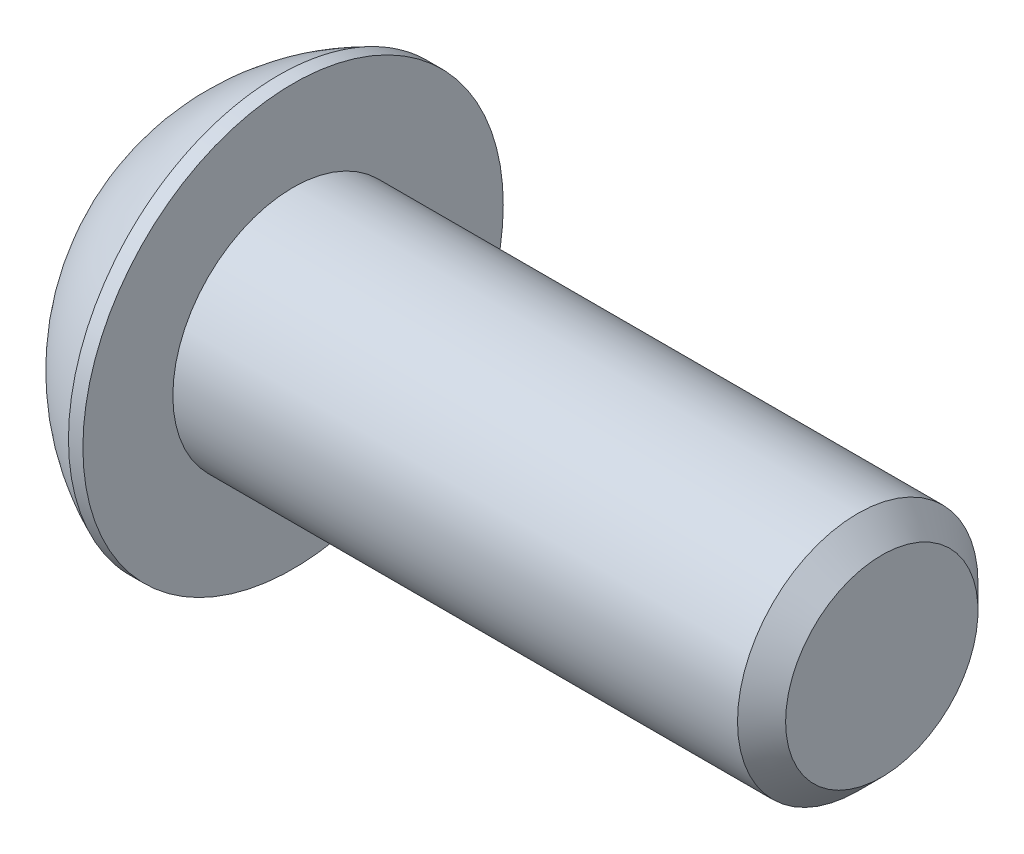
ISO-10303-21;
HEADER;
FILE_DESCRIPTION(('STEP AP214'),'2;1');
FILE_NAME('part.step','',(''),(''),'','','');
FILE_SCHEMA(('AUTOMOTIVE_DESIGN { 1 0 10303 214 1 1 1 1 }'));
ENDSEC;
DATA;
#1=APPLICATION_CONTEXT('core data for automotive mechanical design processes');
#2=APPLICATION_PROTOCOL_DEFINITION('international standard','automotive_design',2000,#1);
#3=PRODUCT_CONTEXT('',#1,'mechanical');
#4=PRODUCT('Part','Part','',(#3));
#5=PRODUCT_RELATED_PRODUCT_CATEGORY('part','',(#4));
#6=PRODUCT_DEFINITION_FORMATION('','',#4);
#7=PRODUCT_DEFINITION_CONTEXT('part definition',#1,'design');
#8=PRODUCT_DEFINITION('design','',#6,#7);
#9=PRODUCT_DEFINITION_SHAPE('','',#8);
#10=(LENGTH_UNIT() NAMED_UNIT(*) SI_UNIT(.MILLI.,.METRE.));
#11=(NAMED_UNIT(*) PLANE_ANGLE_UNIT() SI_UNIT($,.RADIAN.));
#12=(NAMED_UNIT(*) SI_UNIT($,.STERADIAN.) SOLID_ANGLE_UNIT());
#13=UNCERTAINTY_MEASURE_WITH_UNIT(LENGTH_MEASURE(1.E-05),#10,'distance_accuracy_value','');
#14=(GEOMETRIC_REPRESENTATION_CONTEXT(3) GLOBAL_UNCERTAINTY_ASSIGNED_CONTEXT((#13)) GLOBAL_UNIT_ASSIGNED_CONTEXT((#10,
#11,#12)) REPRESENTATION_CONTEXT('',''));
#15=CARTESIAN_POINT('',(0.,0.,0.));
#16=DIRECTION('',(0.,0.,1.));
#17=DIRECTION('',(1.,0.,0.));
#18=AXIS2_PLACEMENT_3D('',#15,#16,#17);
#19=CARTESIAN_POINT('',(1.32080000000034,0.,0.));
#20=DIRECTION('',(-1.,0.,0.));
#21=DIRECTION('',(0.,0.,1.));
#22=AXIS2_PLACEMENT_3D('',#19,#20,#21);
#23=CONICAL_SURFACE('',#22,1.1937999999998,1.04719755119608);
#24=CARTESIAN_POINT('',(2.01004075135902,0.,-4.44089209850063E-13));
#25=VERTEX_POINT('',#24);
#26=VERTEX_LOOP('',#25);
#27=FACE_BOUND('',#26,.T.);
#28=CARTESIAN_POINT('',(1.32080000000009,0.,0.));
#29=DIRECTION('',(-1.,0.,0.));
#30=DIRECTION('',(0.,0.,1.));
#31=AXIS2_PLACEMENT_3D('',#28,#29,#30);
#32=CIRCLE('',#31,1.19380000000024);
#33=CARTESIAN_POINT('',(1.32080000000009,0.,1.19380000000024));
#34=VERTEX_POINT('',#33);
#35=EDGE_CURVE('E20',#34,#34,#32,.T.);
#36=ORIENTED_EDGE('',*,*,#35,.T.);
#37=EDGE_LOOP('',(#36));
#38=FACE_BOUND('',#37,.T.);
#39=ADVANCED_FACE('F17',(#27,#38),#23,.F.);
#40=CARTESIAN_POINT('',(1.3208,-2.29135888084633,0.));
#41=DIRECTION('',(1.,0.,0.));
#42=DIRECTION('',(0.,0.,-1.));
#43=AXIS2_PLACEMENT_3D('',#40,#41,#42);
#44=PLANE('',#43);
#45=DIRECTION('',(0.,1.,0.));
#46=VECTOR('',#45,1.);
#47=CARTESIAN_POINT('',(1.3208,-1.14567944042316,1.984375));
#48=LINE('',#47,#46);
#49=CARTESIAN_POINT('',(1.3208,1.14567944042316,1.984375));
#50=VERTEX_POINT('',#49);
#51=CARTESIAN_POINT('',(1.3208,-1.14567944042316,1.984375));
#52=VERTEX_POINT('',#51);
#53=EDGE_CURVE('E69',#50,#52,#48,.F.);
#54=ORIENTED_EDGE('',*,*,#53,.F.);
#55=DIRECTION('',(0.,0.5,-0.866025403784439));
#56=VECTOR('',#55,1.);
#57=CARTESIAN_POINT('',(1.3208,1.14567944042316,1.984375));
#58=LINE('',#57,#56);
#59=CARTESIAN_POINT('',(1.3208,2.29135888084633,0.));
#60=VERTEX_POINT('',#59);
#61=EDGE_CURVE('E292',#60,#50,#58,.F.);
#62=ORIENTED_EDGE('',*,*,#61,.F.);
#63=DIRECTION('',(0.,-0.5,-0.866025403784439));
#64=VECTOR('',#63,1.);
#65=CARTESIAN_POINT('',(1.3208,2.29135888084633,0.));
#66=LINE('',#65,#64);
#67=CARTESIAN_POINT('',(1.3208,1.14567944042316,-1.984375));
#68=VERTEX_POINT('',#67);
#69=EDGE_CURVE('E296',#68,#60,#66,.F.);
#70=ORIENTED_EDGE('',*,*,#69,.F.);
#71=DIRECTION('',(0.,1.,0.));
#72=VECTOR('',#71,1.);
#73=CARTESIAN_POINT('',(1.3208,1.14567944042316,-1.984375));
#74=LINE('',#73,#72);
#75=CARTESIAN_POINT('',(1.3208,-1.14567944042316,-1.984375));
#76=VERTEX_POINT('',#75);
#77=EDGE_CURVE('E301',#76,#68,#74,.T.);
#78=ORIENTED_EDGE('',*,*,#77,.F.);
#79=DIRECTION('',(0.,-0.500000000000001,0.866025403784438));
#80=VECTOR('',#79,1.);
#81=CARTESIAN_POINT('',(1.3208,-1.14567944042316,-1.984375));
#82=LINE('',#81,#80);
#83=CARTESIAN_POINT('',(1.3208,-2.29135888084633,0.));
#84=VERTEX_POINT('',#83);
#85=EDGE_CURVE('E306',#84,#76,#82,.F.);
#86=ORIENTED_EDGE('',*,*,#85,.F.);
#87=DIRECTION('',(0.,0.500000000000001,0.866025403784438));
#88=VECTOR('',#87,1.);
#89=CARTESIAN_POINT('',(1.3208,-2.29135888084633,0.));
#90=LINE('',#89,#88);
#91=EDGE_CURVE('E82',#52,#84,#90,.F.);
#92=ORIENTED_EDGE('',*,*,#91,.F.);
#93=EDGE_LOOP('',(#54,#62,#70,#78,#86,#92));
#94=FACE_BOUND('',#93,.T.);
#95=ORIENTED_EDGE('',*,*,#35,.F.);
#96=EDGE_LOOP('',(#95));
#97=FACE_BOUND('',#96,.T.);
#98=ADVANCED_FACE('F75',(#94,#97),#44,.F.);
#99=CARTESIAN_POINT('',(1.3208,-1.14567944042316,1.984375));
#100=DIRECTION('',(0.,0.,-1.));
#101=DIRECTION('',(0.,1.,0.));
#102=AXIS2_PLACEMENT_3D('',#99,#100,#101);
#103=PLANE('',#102);
#104=ORIENTED_EDGE('',*,*,#53,.T.);
#105=DIRECTION('',(1.,0.,0.));
#106=VECTOR('',#105,1.);
#107=CARTESIAN_POINT('',(1.3208,-1.14567944042316,1.984375));
#108=LINE('',#107,#106);
#109=CARTESIAN_POINT('',(0.,-1.14567944042316,1.984375));
#110=VERTEX_POINT('',#109);
#111=EDGE_CURVE('E79',#110,#52,#108,.T.);
#112=ORIENTED_EDGE('',*,*,#111,.F.);
#113=DIRECTION('',(0.,1.,0.));
#114=VECTOR('',#113,1.);
#115=CARTESIAN_POINT('',(0.,0.,1.984375));
#116=LINE('',#115,#114);
#117=CARTESIAN_POINT('',(0.,1.14567944042316,1.984375));
#118=VERTEX_POINT('',#117);
#119=EDGE_CURVE('E286',#118,#110,#116,.F.);
#120=ORIENTED_EDGE('',*,*,#119,.F.);
#121=DIRECTION('',(1.,0.,0.));
#122=VECTOR('',#121,1.);
#123=CARTESIAN_POINT('',(1.3208,1.14567944042316,1.984375));
#124=LINE('',#123,#122);
#125=EDGE_CURVE('E289',#50,#118,#124,.F.);
#126=ORIENTED_EDGE('',*,*,#125,.F.);
#127=EDGE_LOOP('',(#104,#112,#120,#126));
#128=FACE_BOUND('',#127,.T.);
#129=ADVANCED_FACE('F128',(#128),#103,.T.);
#130=CARTESIAN_POINT('',(1.3208,-2.29135888084633,0.));
#131=DIRECTION('',(0.,0.866025403784438,-0.500000000000001));
#132=DIRECTION('',(0.,0.500000000000001,0.866025403784438));
#133=AXIS2_PLACEMENT_3D('',#130,#131,#132);
#134=PLANE('',#133);
#135=ORIENTED_EDGE('',*,*,#91,.T.);
#136=DIRECTION('',(1.,0.,0.));
#137=VECTOR('',#136,1.);
#138=CARTESIAN_POINT('',(1.3208,-2.29135888084633,0.));
#139=LINE('',#138,#137);
#140=CARTESIAN_POINT('',(0.,-2.29135888084633,0.));
#141=VERTEX_POINT('',#140);
#142=EDGE_CURVE('E308',#141,#84,#139,.T.);
#143=ORIENTED_EDGE('',*,*,#142,.F.);
#144=DIRECTION('',(0.,-0.500000000000001,-0.866025403784438));
#145=VECTOR('',#144,1.);
#146=CARTESIAN_POINT('',(0.,-1.14567944042316,1.984375));
#147=LINE('',#146,#145);
#148=EDGE_CURVE('E283',#110,#141,#147,.T.);
#149=ORIENTED_EDGE('',*,*,#148,.F.);
#150=ORIENTED_EDGE('',*,*,#111,.T.);
#151=EDGE_LOOP('',(#135,#143,#149,#150));
#152=FACE_BOUND('',#151,.T.);
#153=ADVANCED_FACE('F124',(#152),#134,.T.);
#154=CARTESIAN_POINT('',(1.3208,-1.14567944042316,-1.984375));
#155=DIRECTION('',(0.,0.866025403784438,0.500000000000001));
#156=DIRECTION('',(0.,-0.500000000000001,0.866025403784438));
#157=AXIS2_PLACEMENT_3D('',#154,#155,#156);
#158=PLANE('',#157);
#159=ORIENTED_EDGE('',*,*,#85,.T.);
#160=DIRECTION('',(1.,0.,0.));
#161=VECTOR('',#160,1.);
#162=CARTESIAN_POINT('',(1.3208,-1.14567944042316,-1.984375));
#163=LINE('',#162,#161);
#164=CARTESIAN_POINT('',(0.,-1.14567944042316,-1.984375));
#165=VERTEX_POINT('',#164);
#166=EDGE_CURVE('E303',#165,#76,#163,.T.);
#167=ORIENTED_EDGE('',*,*,#166,.F.);
#168=DIRECTION('',(0.,0.500000000000001,-0.866025403784438));
#169=VECTOR('',#168,1.);
#170=CARTESIAN_POINT('',(0.,-2.29135888084633,0.));
#171=LINE('',#170,#169);
#172=EDGE_CURVE('E280',#141,#165,#171,.T.);
#173=ORIENTED_EDGE('',*,*,#172,.F.);
#174=ORIENTED_EDGE('',*,*,#142,.T.);
#175=EDGE_LOOP('',(#159,#167,#173,#174));
#176=FACE_BOUND('',#175,.T.);
#177=ADVANCED_FACE('F120',(#176),#158,.T.);
#178=CARTESIAN_POINT('',(1.3208,1.14567944042316,-1.984375));
#179=DIRECTION('',(0.,0.,1.));
#180=DIRECTION('',(1.,0.,0.));
#181=AXIS2_PLACEMENT_3D('',#178,#179,#180);
#182=PLANE('',#181);
#183=ORIENTED_EDGE('',*,*,#77,.T.);
#184=DIRECTION('',(1.,0.,0.));
#185=VECTOR('',#184,1.);
#186=CARTESIAN_POINT('',(1.3208,1.14567944042316,-1.984375));
#187=LINE('',#186,#185);
#188=CARTESIAN_POINT('',(0.,1.14567944042316,-1.984375));
#189=VERTEX_POINT('',#188);
#190=EDGE_CURVE('E298',#189,#68,#187,.T.);
#191=ORIENTED_EDGE('',*,*,#190,.F.);
#192=DIRECTION('',(0.,1.,0.));
#193=VECTOR('',#192,1.);
#194=CARTESIAN_POINT('',(0.,0.,-1.984375));
#195=LINE('',#194,#193);
#196=EDGE_CURVE('E277',#165,#189,#195,.T.);
#197=ORIENTED_EDGE('',*,*,#196,.F.);
#198=ORIENTED_EDGE('',*,*,#166,.T.);
#199=EDGE_LOOP('',(#183,#191,#197,#198));
#200=FACE_BOUND('',#199,.T.);
#201=ADVANCED_FACE('F117',(#200),#182,.T.);
#202=CARTESIAN_POINT('',(1.3208,2.29135888084633,0.));
#203=DIRECTION('',(0.,-0.866025403784439,0.5));
#204=DIRECTION('',(0.,-0.5,-0.866025403784439));
#205=AXIS2_PLACEMENT_3D('',#202,#203,#204);
#206=PLANE('',#205);
#207=ORIENTED_EDGE('',*,*,#69,.T.);
#208=DIRECTION('',(1.,0.,0.));
#209=VECTOR('',#208,1.);
#210=CARTESIAN_POINT('',(1.3208,2.29135888084633,0.));
#211=LINE('',#210,#209);
#212=CARTESIAN_POINT('',(0.,2.29135888084633,0.));
#213=VERTEX_POINT('',#212);
#214=EDGE_CURVE('E35',#213,#60,#211,.T.);
#215=ORIENTED_EDGE('',*,*,#214,.F.);
#216=DIRECTION('',(0.,0.5,0.866025403784439));
#217=VECTOR('',#216,1.);
#218=CARTESIAN_POINT('',(0.,1.14567944042316,-1.984375));
#219=LINE('',#218,#217);
#220=EDGE_CURVE('E274',#189,#213,#219,.T.);
#221=ORIENTED_EDGE('',*,*,#220,.F.);
#222=ORIENTED_EDGE('',*,*,#190,.T.);
#223=EDGE_LOOP('',(#207,#215,#221,#222));
#224=FACE_BOUND('',#223,.T.);
#225=ADVANCED_FACE('F113',(#224),#206,.T.);
#226=CARTESIAN_POINT('',(1.3208,1.14567944042316,1.984375));
#227=DIRECTION('',(0.,-0.866025403784439,-0.5));
#228=DIRECTION('',(0.,0.5,-0.866025403784439));
#229=AXIS2_PLACEMENT_3D('',#226,#227,#228);
#230=PLANE('',#229);
#231=ORIENTED_EDGE('',*,*,#61,.T.);
#232=ORIENTED_EDGE('',*,*,#125,.T.);
#233=DIRECTION('',(0.,-0.5,0.866025403784438));
#234=VECTOR('',#233,1.);
#235=CARTESIAN_POINT('',(0.,2.29135888084633,0.));
#236=LINE('',#235,#234);
#237=EDGE_CURVE('E100',#213,#118,#236,.T.);
#238=ORIENTED_EDGE('',*,*,#237,.F.);
#239=ORIENTED_EDGE('',*,*,#214,.T.);
#240=EDGE_LOOP('',(#231,#232,#238,#239));
#241=FACE_BOUND('',#240,.T.);
#242=ADVANCED_FACE('F109',(#241),#230,.T.);
#243=CARTESIAN_POINT('',(0.,0.,0.));
#244=DIRECTION('',(-1.,0.,0.));
#245=DIRECTION('',(0.,0.,1.));
#246=AXIS2_PLACEMENT_3D('',#243,#244,#245);
#247=PLANE('',#246);
#248=ORIENTED_EDGE('',*,*,#220,.T.);
#249=ORIENTED_EDGE('',*,*,#237,.T.);
#250=ORIENTED_EDGE('',*,*,#119,.T.);
#251=ORIENTED_EDGE('',*,*,#148,.T.);
#252=ORIENTED_EDGE('',*,*,#172,.T.);
#253=ORIENTED_EDGE('',*,*,#196,.T.);
#254=EDGE_LOOP('',(#248,#249,#250,#251,#252,#253));
#255=FACE_BOUND('',#254,.T.);
#256=CARTESIAN_POINT('',(0.,2.77495,0.));
#257=CARTESIAN_POINT('',(0.,2.77494953309947,0.0779118937523459));
#258=CARTESIAN_POINT('',(0.,2.77166578388025,0.15583810591977));
#259=CARTESIAN_POINT('',(0.,2.75855213600204,0.311152012455904));
#260=CARTESIAN_POINT('',(0.,2.74872030471467,0.388539541019556));
#261=CARTESIAN_POINT('',(0.,2.72255472645676,0.542341518735717));
#262=CARTESIAN_POINT('',(-2.70414110576258E-13,2.70621065843663,0.618754223567578));
#263=CARTESIAN_POINT('',(2.71501725221868E-13,2.66713326915777,0.769973634286023));
#264=CARTESIAN_POINT('',(1.01274952524446E-12,2.64439476297869,0.844778983646282));
#265=CARTESIAN_POINT('',(1.81909959813207E-12,2.56690195943351,1.06566239301792));
#266=CARTESIAN_POINT('',(4.77081687541822E-13,2.50280672569928,1.20857954243987));
#267=CARTESIAN_POINT('',(-4.76232447128612E-13,2.35149826934097,1.48160874561538));
#268=CARTESIAN_POINT('',(0.,2.26428416790397,1.61172031233499));
#269=CARTESIAN_POINT('',(0.,2.1181093928834,1.79445660654268));
#270=CARTESIAN_POINT('',(0.,2.06678693791626,1.85333128513996));
#271=CARTESIAN_POINT('',(0.,1.95940522984449,1.96650727912792));
#272=CARTESIAN_POINT('',(0.,1.90335059143535,2.02081294920044));
#273=CARTESIAN_POINT('',(0.,1.78683891013963,2.12453280878582));
#274=CARTESIAN_POINT('',(0.,1.72637988450322,2.1739447713554));
#275=CARTESIAN_POINT('',(0.,1.60151968865711,2.26750481692908));
#276=CARTESIAN_POINT('',(0.,1.53711760864537,2.31165167810847));
#277=CARTESIAN_POINT('',(0.,1.33869902291632,2.43567242603944));
#278=CARTESIAN_POINT('',(0.,1.19934704110695,2.507235886628));
#279=CARTESIAN_POINT('',(0.,0.910681609121881,2.62590828672821));
#280=CARTESIAN_POINT('',(0.,0.761368265357398,2.67301748742278));
#281=CARTESIAN_POINT('',(0.,0.456932649466623,2.74151230664007));
#282=CARTESIAN_POINT('',(0.,0.301810346322584,2.76289778778721));
#283=CARTESIAN_POINT('',(0.,-0.00982263870895171,2.77931595661156));
#284=CARTESIAN_POINT('',(0.,-0.166333320596448,2.77434864428877));
#285=CARTESIAN_POINT('',(0.,-0.476280836814452,2.73822217653073));
#286=CARTESIAN_POINT('',(0.,-0.629717687555985,2.70706316096981));
#287=CARTESIAN_POINT('',(0.,-0.929254830044274,2.61937980771149));
#288=CARTESIAN_POINT('',(0.,-1.0753550434132,2.56285519909568));
#289=CARTESIAN_POINT('',(0.,-1.28570692598579,2.46037024128109));
#290=CARTESIAN_POINT('',(0.,-1.35439130022287,2.42323494812896));
#291=CARTESIAN_POINT('',(0.,-1.488391287199,2.34331277270256));
#292=CARTESIAN_POINT('',(0.,-1.55370767631787,2.30052720108831));
#293=CARTESIAN_POINT('',(0.,-1.68047292776594,2.20962421887055));
#294=CARTESIAN_POINT('',(0.,-1.7419235278682,2.16150923122348));
#295=CARTESIAN_POINT('',(0.,-1.86060297067992,2.06024311301283));
#296=CARTESIAN_POINT('',(0.,-1.91782768181715,2.0070871669763));
#297=CARTESIAN_POINT('',(0.,-2.08239462196651,1.8407220856554));
#298=CARTESIAN_POINT('',(0.,-2.18279764272601,1.72049499758422));
#299=CARTESIAN_POINT('',(0.,-2.36195754944063,1.46487629213018));
#300=CARTESIAN_POINT('',(0.,-2.44071525816758,1.32948525142807));
#301=CARTESIAN_POINT('',(0.,-2.54098882695274,1.11796734074395));
#302=CARTESIAN_POINT('',(0.,-2.57146177392727,1.04596540008347));
#303=CARTESIAN_POINT('',(0.,-2.62621251108999,0.899689259475764));
#304=CARTESIAN_POINT('',(0.,-2.65049531495563,0.825416953360952));
#305=CARTESIAN_POINT('',(0.,-2.69267708798766,0.675215808695207));
#306=CARTESIAN_POINT('',(0.,-2.71058613777937,0.599289789313092));
#307=CARTESIAN_POINT('',(0.,-2.73994710360127,0.446213628496932));
#308=CARTESIAN_POINT('',(0.,-2.75140092413871,0.369063855024788));
#309=CARTESIAN_POINT('',(0.,-2.76470470685522,0.24316208817343));
#310=CARTESIAN_POINT('',(0.,-2.76854547596618,0.194611672428577));
#311=CARTESIAN_POINT('',(0.,-2.77366826843264,0.0973760351839812));
#312=CARTESIAN_POINT('',(0.,-2.77495029178814,0.0486908136842395));
#313=CARTESIAN_POINT('',(0.,-2.77494953309947,-0.0779118937523475));
#314=CARTESIAN_POINT('',(0.,-2.77166578388025,-0.155838105919772));
#315=CARTESIAN_POINT('',(0.,-2.75855213600204,-0.311152012455906));
#316=CARTESIAN_POINT('',(0.,-2.74872030471467,-0.388539541019558));
#317=CARTESIAN_POINT('',(0.,-2.72255472645677,-0.542341518735719));
#318=CARTESIAN_POINT('',(-2.70149297926331E-13,-2.70621065843663,-0.61875422356758));
#319=CARTESIAN_POINT('',(2.712366972268E-13,-2.66713326915777,-0.769973634286024));
#320=CARTESIAN_POINT('',(1.0114146773846E-12,-2.64439476297869,-0.844778983646283));
#321=CARTESIAN_POINT('',(1.81656702958366E-12,-2.5669019594335,-1.06566239301792));
#322=CARTESIAN_POINT('',(4.7641829195856E-13,-2.50280672569928,-1.20857954243988));
#323=CARTESIAN_POINT('',(-4.75569026324205E-13,-2.35149826934097,-1.48160874561538));
#324=CARTESIAN_POINT('',(0.,-2.26428416790396,-1.61172031233499));
#325=CARTESIAN_POINT('',(0.,-2.1181093928834,-1.79445660654268));
#326=CARTESIAN_POINT('',(0.,-2.06678693791626,-1.85333128513997));
#327=CARTESIAN_POINT('',(0.,-1.95940522984449,-1.96650727912792));
#328=CARTESIAN_POINT('',(0.,-1.90335059143535,-2.02081294920044));
#329=CARTESIAN_POINT('',(0.,-1.78683891013963,-2.12453280878582));
#330=CARTESIAN_POINT('',(0.,-1.72637988450322,-2.1739447713554));
#331=CARTESIAN_POINT('',(0.,-1.60151968865711,-2.26750481692908));
#332=CARTESIAN_POINT('',(0.,-1.53711760864537,-2.31165167810847));
#333=CARTESIAN_POINT('',(0.,-1.33869902291632,-2.43567242603944));
#334=CARTESIAN_POINT('',(0.,-1.19934704110695,-2.507235886628));
#335=CARTESIAN_POINT('',(0.,-0.91068160912188,-2.62590828672821));
#336=CARTESIAN_POINT('',(0.,-0.761368265357396,-2.67301748742278));
#337=CARTESIAN_POINT('',(0.,-0.456932649466621,-2.74151230664007));
#338=CARTESIAN_POINT('',(0.,-0.301810346322582,-2.76289778778721));
#339=CARTESIAN_POINT('',(0.,0.00982263870895353,-2.77931595661156));
#340=CARTESIAN_POINT('',(0.,0.16633332059645,-2.77434864428876));
#341=CARTESIAN_POINT('',(0.,0.476280836814454,-2.73822217653073));
#342=CARTESIAN_POINT('',(0.,0.629717687555987,-2.70706316096981));
#343=CARTESIAN_POINT('',(0.,0.929254830044276,-2.6193798077115));
#344=CARTESIAN_POINT('',(0.,1.0753550434132,-2.56285519909568));
#345=CARTESIAN_POINT('',(0.,1.28570692598579,-2.46037024128109));
#346=CARTESIAN_POINT('',(0.,1.35439130022287,-2.42323494812896));
#347=CARTESIAN_POINT('',(0.,1.488391287199,-2.34331277270256));
#348=CARTESIAN_POINT('',(0.,1.55370767631787,-2.30052720108831));
#349=CARTESIAN_POINT('',(0.,1.68047292776594,-2.20962421887055));
#350=CARTESIAN_POINT('',(0.,1.7419235278682,-2.16150923122348));
#351=CARTESIAN_POINT('',(0.,1.86060297067992,-2.06024311301282));
#352=CARTESIAN_POINT('',(0.,1.91782768181716,-2.0070871669763));
#353=CARTESIAN_POINT('',(0.,2.08239462196651,-1.8407220856554));
#354=CARTESIAN_POINT('',(0.,2.18279764272601,-1.72049499758422));
#355=CARTESIAN_POINT('',(0.,2.36195754944063,-1.46487629213018));
#356=CARTESIAN_POINT('',(0.,2.44071525816757,-1.32948525142807));
#357=CARTESIAN_POINT('',(0.,2.54098882695273,-1.11796734074395));
#358=CARTESIAN_POINT('',(0.,2.57146177392727,-1.04596540008347));
#359=CARTESIAN_POINT('',(0.,2.62621251108999,-0.899689259475765));
#360=CARTESIAN_POINT('',(0.,2.65049531495563,-0.825416953360953));
#361=CARTESIAN_POINT('',(0.,2.69267708798766,-0.675215808695207));
#362=CARTESIAN_POINT('',(0.,2.71058613777936,-0.599289789313092));
#363=CARTESIAN_POINT('',(0.,2.73994710360127,-0.446213628496932));
#364=CARTESIAN_POINT('',(0.,2.75140092413871,-0.369063855024789));
#365=CARTESIAN_POINT('',(0.,2.76470470685522,-0.243162088173432));
#366=CARTESIAN_POINT('',(0.,2.76854547596618,-0.194611672428578));
#367=CARTESIAN_POINT('',(0.,2.77366826843264,-0.0973760351839823));
#368=CARTESIAN_POINT('',(0.,2.77495029178814,-0.0486908136842408));
#369=CARTESIAN_POINT('',(0.,2.77495,0.));
#370=B_SPLINE_CURVE_WITH_KNOTS('',3,(#256,#257,#258,#259,#260,#261,#262,#263,#264,#265,#266,
#267,#268,#269,#270,#271,#272,#273,#274,#275,#276,#277,#278,#279,#280,#281,#282,#283,#284,#285,
#286,#287,#288,#289,#290,#291,#292,#293,#294,#295,#296,#297,#298,#299,#300,#301,#302,#303,#304,
#305,#306,#307,#308,#309,#310,#311,#312,#313,#314,#315,#316,#317,#318,#319,#320,#321,#322,#323,
#324,#325,#326,#327,#328,#329,#330,#331,#332,#333,#334,#335,#336,#337,#338,#339,#340,#341,#342,
#343,#344,#345,#346,#347,#348,#349,#350,#351,#352,#353,#354,#355,#356,#357,#358,#359,#360,#361,
#362,#363,#364,#365,#366,#367,#368,#369),.UNSPECIFIED.,.T.,.F.,(4,2,2,2,2,2,2,2,2,2,2,2,2,2,2,2,
2,2,2,2,2,2,2,2,2,2,2,2,2,2,2,2,2,2,2,2,2,2,2,2,2,2,2,2,2,2,2,2,2,2,2,2,2,2,2,2,4),(0.,
0.233690856748162,0.467450716578751,0.701582538521471,0.935904756015414,1.40343220467667,
1.87097742791502,2.10505636898837,2.33890962270652,2.57286880998746,2.80688218486306,
3.27442101763127,3.74195485676357,4.20949119271389,4.67702752866417,5.14456136779641,
5.61210020056468,5.84611357544033,6.08007276272136,6.31392601643949,6.54800495751273,
7.01555018075072,7.48307762941212,7.71739984690652,7.95153166884955,8.18529152868023,
8.41898238542855,8.56502681353347,8.71107124163843,8.94476209838659,9.17852195821718,
9.4126537801599,9.64697599765384,10.1145034463151,10.5820486695534,10.8161276106268,
11.0499808643449,11.2839400516259,11.5179534265015,11.9854922592697,12.453026098402,
12.9205624343523,13.3880987703026,13.8556326094348,14.3231714422031,14.5571848170788,
14.7911440043598,15.0249972580779,15.2590761991512,15.7266214223891,16.1941488710506,
16.4284710885449,16.662602910488,16.8963627703186,17.130053627067,17.2760980551719,
17.4221424832769),.UNSPECIFIED.);
#371=CARTESIAN_POINT('',(0.,2.77495,0.));
#372=VERTEX_POINT('',#371);
#373=EDGE_CURVE('E94',#372,#372,#370,.T.);
#374=ORIENTED_EDGE('',*,*,#373,.F.);
#375=EDGE_LOOP('',(#374));
#376=FACE_BOUND('',#375,.T.);
#377=ADVANCED_FACE('F105',(#255,#376),#247,.T.);
#378=CARTESIAN_POINT('',(5.37260881410256,0.,0.));
#379=DIRECTION('',(0.,1.,0.));
#380=DIRECTION('',(1.,0.,0.));
#381=AXIS2_PLACEMENT_3D('',#378,#379,#380);
#382=SPHERICAL_SURFACE('',#381,6.04692260342999);
#383=CARTESIAN_POINT('',(2.9718,0.,0.));
#384=DIRECTION('',(-1.,0.,0.));
#385=DIRECTION('',(0.,0.,1.));
#386=AXIS2_PLACEMENT_3D('',#383,#384,#385);
#387=CIRCLE('',#386,5.5499);
#388=CARTESIAN_POINT('',(2.9718,0.,5.5499));
#389=VERTEX_POINT('',#388);
#390=EDGE_CURVE('E92',#389,#389,#387,.F.);
#391=ORIENTED_EDGE('',*,*,#390,.F.);
#392=EDGE_LOOP('',(#391));
#393=FACE_BOUND('',#392,.T.);
#394=ORIENTED_EDGE('',*,*,#373,.T.);
#395=EDGE_LOOP('',(#394));
#396=FACE_BOUND('',#395,.T.);
#397=ADVANCED_FACE('F101',(#393,#396),#382,.T.);
#398=CARTESIAN_POINT('',(18.8976,0.,0.));
#399=DIRECTION('',(-1.,0.,0.));
#400=DIRECTION('',(0.,0.,1.));
#401=AXIS2_PLACEMENT_3D('',#398,#399,#400);
#402=PLANE('',#401);
#403=CARTESIAN_POINT('',(18.8976000000025,0.,0.));
#404=DIRECTION('',(-1.,0.,0.));
#405=DIRECTION('',(0.,0.,1.));
#406=AXIS2_PLACEMENT_3D('',#403,#404,#405);
#407=CIRCLE('',#406,2.54000000001042);
#408=CARTESIAN_POINT('',(18.8976000000025,0.,2.54000000001042));
#409=VERTEX_POINT('',#408);
#410=EDGE_CURVE('E89',#409,#409,#407,.T.);
#411=ORIENTED_EDGE('',*,*,#410,.F.);
#412=EDGE_LOOP('',(#411));
#413=FACE_BOUND('',#412,.T.);
#414=ADVANCED_FACE('F154',(#413),#402,.F.);
#415=CARTESIAN_POINT('',(0.,0.,0.));
#416=DIRECTION('',(-1.,0.,0.));
#417=DIRECTION('',(0.,0.,1.));
#418=AXIS2_PLACEMENT_3D('',#415,#416,#417);
#419=CYLINDRICAL_SURFACE('',#418,5.5499);
#420=ORIENTED_EDGE('',*,*,#390,.T.);
#421=EDGE_LOOP('',(#420));
#422=FACE_BOUND('',#421,.T.);
#423=CARTESIAN_POINT('',(3.3528,0.,0.));
#424=DIRECTION('',(-1.,0.,0.));
#425=DIRECTION('',(0.,0.,1.));
#426=AXIS2_PLACEMENT_3D('',#423,#424,#425);
#427=CIRCLE('',#426,5.5499);
#428=CARTESIAN_POINT('',(3.3528,0.,5.5499));
#429=VERTEX_POINT('',#428);
#430=EDGE_CURVE('E86',#429,#429,#427,.T.);
#431=ORIENTED_EDGE('',*,*,#430,.T.);
#432=EDGE_LOOP('',(#431));
#433=FACE_BOUND('',#432,.T.);
#434=ADVANCED_FACE('F151',(#422,#433),#419,.T.);
#435=CARTESIAN_POINT('',(18.2626000001278,0.,0.));
#436=DIRECTION('',(-1.,0.,0.));
#437=DIRECTION('',(0.,0.,1.));
#438=AXIS2_PLACEMENT_3D('',#435,#436,#437);
#439=CONICAL_SURFACE('',#438,3.17499999988513,0.785398163397448);
#440=CARTESIAN_POINT('',(18.2626,0.,0.));
#441=DIRECTION('',(-1.,0.,0.));
#442=DIRECTION('',(0.,0.,1.));
#443=AXIS2_PLACEMENT_3D('',#440,#441,#442);
#444=CIRCLE('',#443,3.175);
#445=CARTESIAN_POINT('',(18.2626,0.,3.175));
#446=VERTEX_POINT('',#445);
#447=EDGE_CURVE('E26',#446,#446,#444,.T.);
#448=ORIENTED_EDGE('',*,*,#447,.F.);
#449=EDGE_LOOP('',(#448));
#450=FACE_BOUND('',#449,.T.);
#451=ORIENTED_EDGE('',*,*,#410,.T.);
#452=EDGE_LOOP('',(#451));
#453=FACE_BOUND('',#452,.T.);
#454=ADVANCED_FACE('F144',(#450,#453),#439,.T.);
#455=CARTESIAN_POINT('',(3.3528,3.175,0.));
#456=DIRECTION('',(-1.,0.,0.));
#457=DIRECTION('',(0.,0.,1.));
#458=AXIS2_PLACEMENT_3D('',#455,#456,#457);
#459=PLANE('',#458);
#460=CARTESIAN_POINT('',(3.3528,0.,0.));
#461=DIRECTION('',(-1.,0.,0.));
#462=DIRECTION('',(0.,0.,1.));
#463=AXIS2_PLACEMENT_3D('',#460,#461,#462);
#464=CIRCLE('',#463,3.175);
#465=CARTESIAN_POINT('',(3.3528,0.,3.175));
#466=VERTEX_POINT('',#465);
#467=EDGE_CURVE('E11',#466,#466,#464,.F.);
#468=ORIENTED_EDGE('',*,*,#467,.F.);
#469=EDGE_LOOP('',(#468));
#470=FACE_BOUND('',#469,.T.);
#471=ORIENTED_EDGE('',*,*,#430,.F.);
#472=EDGE_LOOP('',(#471));
#473=FACE_BOUND('',#472,.T.);
#474=ADVANCED_FACE('F138',(#470,#473),#459,.F.);
#475=CARTESIAN_POINT('',(0.,0.,0.));
#476=DIRECTION('',(-1.,0.,0.));
#477=DIRECTION('',(0.,0.,1.));
#478=AXIS2_PLACEMENT_3D('',#475,#476,#477);
#479=CYLINDRICAL_SURFACE('',#478,3.175);
#480=ORIENTED_EDGE('',*,*,#467,.T.);
#481=EDGE_LOOP('',(#480));
#482=FACE_BOUND('',#481,.T.);
#483=ORIENTED_EDGE('',*,*,#447,.T.);
#484=EDGE_LOOP('',(#483));
#485=FACE_BOUND('',#484,.T.);
#486=ADVANCED_FACE('F136',(#482,#485),#479,.T.);
#487=CLOSED_SHELL('',(#39,#98,#129,#153,#177,#201,#225,#242,#377,#397,#414,#434,#454,#474,#486));
#488=MANIFOLD_SOLID_BREP('B1',#487);
#489=ADVANCED_BREP_SHAPE_REPRESENTATION('',(#18,#488),#14);
#490=SHAPE_DEFINITION_REPRESENTATION(#9,#489);
ENDSEC;
END-ISO-10303-21;
